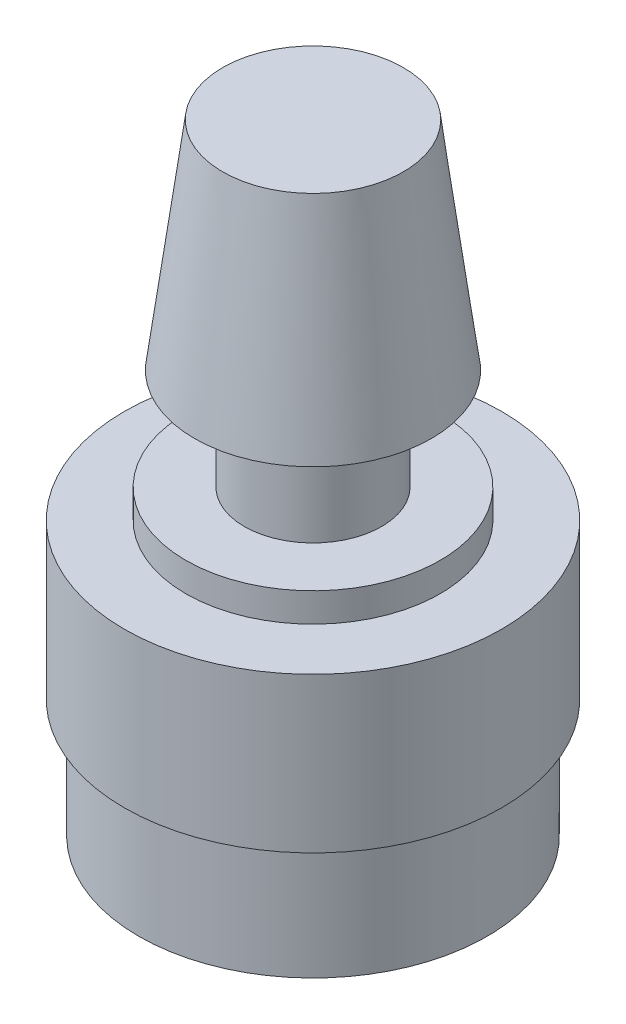
ISO-10303-21;
HEADER;
FILE_DESCRIPTION(('STEP AP214'),'2;1');
FILE_NAME('part.step','',(''),(''),'','','');
FILE_SCHEMA(('AUTOMOTIVE_DESIGN { 1 0 10303 214 1 1 1 1 }'));
ENDSEC;
DATA;
#1=APPLICATION_CONTEXT('core data for automotive mechanical design processes');
#2=APPLICATION_PROTOCOL_DEFINITION('international standard','automotive_design',2000,#1);
#3=PRODUCT_CONTEXT('',#1,'mechanical');
#4=PRODUCT('Part','Part','',(#3));
#5=PRODUCT_RELATED_PRODUCT_CATEGORY('part','',(#4));
#6=PRODUCT_DEFINITION_FORMATION('','',#4);
#7=PRODUCT_DEFINITION_CONTEXT('part definition',#1,'design');
#8=PRODUCT_DEFINITION('design','',#6,#7);
#9=PRODUCT_DEFINITION_SHAPE('','',#8);
#10=(LENGTH_UNIT() NAMED_UNIT(*) SI_UNIT(.MILLI.,.METRE.));
#11=(NAMED_UNIT(*) PLANE_ANGLE_UNIT() SI_UNIT($,.RADIAN.));
#12=(NAMED_UNIT(*) SI_UNIT($,.STERADIAN.) SOLID_ANGLE_UNIT());
#13=UNCERTAINTY_MEASURE_WITH_UNIT(LENGTH_MEASURE(1.E-05),#10,'distance_accuracy_value','');
#14=(GEOMETRIC_REPRESENTATION_CONTEXT(3) GLOBAL_UNCERTAINTY_ASSIGNED_CONTEXT((#13)) GLOBAL_UNIT_ASSIGNED_CONTEXT((#10,
#11,#12)) REPRESENTATION_CONTEXT('',''));
#15=CARTESIAN_POINT('',(0.,0.,0.));
#16=DIRECTION('',(0.,0.,1.));
#17=DIRECTION('',(1.,0.,0.));
#18=AXIS2_PLACEMENT_3D('',#15,#16,#17);
#19=CARTESIAN_POINT('',(0.,0.,0.));
#20=DIRECTION('',(0.,1.,0.));
#21=DIRECTION('',(0.,0.,1.));
#22=AXIS2_PLACEMENT_3D('',#19,#20,#21);
#23=PLANE('',#22);
#24=CARTESIAN_POINT('',(0.,0.,0.));
#25=DIRECTION('',(0.,1.,0.));
#26=DIRECTION('',(0.,0.,1.));
#27=AXIS2_PLACEMENT_3D('',#24,#25,#26);
#28=CIRCLE('',#27,13.05);
#29=CARTESIAN_POINT('',(0.,0.,13.05));
#30=VERTEX_POINT('',#29);
#31=EDGE_CURVE('E42',#30,#30,#28,.T.);
#32=ORIENTED_EDGE('',*,*,#31,.F.);
#33=EDGE_LOOP('',(#32));
#34=FACE_BOUND('',#33,.T.);
#35=CARTESIAN_POINT('',(0.,0.,0.));
#36=DIRECTION('',(0.,1.,0.));
#37=DIRECTION('',(0.,0.,1.));
#38=AXIS2_PLACEMENT_3D('',#35,#36,#37);
#39=CIRCLE('',#38,12.05);
#40=CARTESIAN_POINT('',(0.,0.,12.05));
#41=VERTEX_POINT('',#40);
#42=EDGE_CURVE('E10',#41,#41,#39,.F.);
#43=ORIENTED_EDGE('',*,*,#42,.F.);
#44=EDGE_LOOP('',(#43));
#45=FACE_BOUND('',#44,.T.);
#46=ADVANCED_FACE('F31',(#34,#45),#23,.F.);
#47=CARTESIAN_POINT('',(0.,12.7,0.));
#48=DIRECTION('',(0.,1.,0.));
#49=DIRECTION('',(0.,0.,1.));
#50=AXIS2_PLACEMENT_3D('',#47,#48,#49);
#51=PLANE('',#50);
#52=CARTESIAN_POINT('',(0.,12.7,0.));
#53=DIRECTION('',(0.,1.,0.));
#54=DIRECTION('',(0.,0.,1.));
#55=AXIS2_PLACEMENT_3D('',#52,#53,#54);
#56=CIRCLE('',#55,8.8);
#57=CARTESIAN_POINT('',(0.,12.7,8.8));
#58=VERTEX_POINT('',#57);
#59=EDGE_CURVE('E47',#58,#58,#56,.T.);
#60=ORIENTED_EDGE('',*,*,#59,.T.);
#61=EDGE_LOOP('',(#60));
#62=FACE_BOUND('',#61,.T.);
#63=CARTESIAN_POINT('',(0.,12.7,0.));
#64=DIRECTION('',(0.,1.,0.));
#65=DIRECTION('',(0.,0.,1.));
#66=AXIS2_PLACEMENT_3D('',#63,#64,#65);
#67=CIRCLE('',#66,4.75);
#68=CARTESIAN_POINT('',(0.,12.7,4.75));
#69=VERTEX_POINT('',#68);
#70=EDGE_CURVE('E55',#69,#69,#67,.T.);
#71=ORIENTED_EDGE('',*,*,#70,.F.);
#72=EDGE_LOOP('',(#71));
#73=FACE_BOUND('',#72,.T.);
#74=ADVANCED_FACE('F99',(#62,#73),#51,.T.);
#75=CARTESIAN_POINT('',(0.,10.7,0.));
#76=DIRECTION('',(0.,1.,0.));
#77=DIRECTION('',(0.,0.,1.));
#78=AXIS2_PLACEMENT_3D('',#75,#76,#77);
#79=PLANE('',#78);
#80=CARTESIAN_POINT('',(0.,10.7,0.));
#81=DIRECTION('',(0.,1.,0.));
#82=DIRECTION('',(0.,0.,1.));
#83=AXIS2_PLACEMENT_3D('',#80,#81,#82);
#84=CIRCLE('',#83,13.05);
#85=CARTESIAN_POINT('',(0.,10.7,13.05));
#86=VERTEX_POINT('',#85);
#87=EDGE_CURVE('E38',#86,#86,#84,.T.);
#88=ORIENTED_EDGE('',*,*,#87,.T.);
#89=EDGE_LOOP('',(#88));
#90=FACE_BOUND('',#89,.T.);
#91=CARTESIAN_POINT('',(0.,10.7,0.));
#92=DIRECTION('',(0.,1.,0.));
#93=DIRECTION('',(0.,0.,1.));
#94=AXIS2_PLACEMENT_3D('',#91,#92,#93);
#95=CIRCLE('',#94,8.8);
#96=CARTESIAN_POINT('',(0.,10.7,8.8));
#97=VERTEX_POINT('',#96);
#98=EDGE_CURVE('E49',#97,#97,#95,.T.);
#99=ORIENTED_EDGE('',*,*,#98,.F.);
#100=EDGE_LOOP('',(#99));
#101=FACE_BOUND('',#100,.T.);
#102=ADVANCED_FACE('F101',(#90,#101),#79,.T.);
#103=CARTESIAN_POINT('',(0.,10.7,0.));
#104=DIRECTION('',(0.,-1.,0.));
#105=DIRECTION('',(0.,0.,-1.));
#106=AXIS2_PLACEMENT_3D('',#103,#104,#105);
#107=CYLINDRICAL_SURFACE('',#106,13.05);
#108=ORIENTED_EDGE('',*,*,#87,.F.);
#109=EDGE_LOOP('',(#108));
#110=FACE_BOUND('',#109,.T.);
#111=ORIENTED_EDGE('',*,*,#31,.T.);
#112=EDGE_LOOP('',(#111));
#113=FACE_BOUND('',#112,.T.);
#114=ADVANCED_FACE('F33',(#110,#113),#107,.T.);
#115=CARTESIAN_POINT('',(0.,12.7,0.));
#116=DIRECTION('',(0.,-1.,0.));
#117=DIRECTION('',(0.,0.,-1.));
#118=AXIS2_PLACEMENT_3D('',#115,#116,#117);
#119=CYLINDRICAL_SURFACE('',#118,8.8);
#120=ORIENTED_EDGE('',*,*,#59,.F.);
#121=EDGE_LOOP('',(#120));
#122=FACE_BOUND('',#121,.T.);
#123=ORIENTED_EDGE('',*,*,#98,.T.);
#124=EDGE_LOOP('',(#123));
#125=FACE_BOUND('',#124,.T.);
#126=ADVANCED_FACE('F95',(#122,#125),#119,.T.);
#127=CARTESIAN_POINT('',(0.,19.7,0.));
#128=DIRECTION('',(0.,-1.,0.));
#129=DIRECTION('',(0.,0.,-1.));
#130=AXIS2_PLACEMENT_3D('',#127,#128,#129);
#131=CYLINDRICAL_SURFACE('',#130,4.75);
#132=CARTESIAN_POINT('',(0.,19.7,0.));
#133=DIRECTION('',(0.,1.,0.));
#134=DIRECTION('',(0.,0.,1.));
#135=AXIS2_PLACEMENT_3D('',#132,#133,#134);
#136=CIRCLE('',#135,4.75);
#137=CARTESIAN_POINT('',(0.,19.7,4.75));
#138=VERTEX_POINT('',#137);
#139=EDGE_CURVE('E52',#138,#138,#136,.T.);
#140=ORIENTED_EDGE('',*,*,#139,.F.);
#141=EDGE_LOOP('',(#140));
#142=FACE_BOUND('',#141,.T.);
#143=ORIENTED_EDGE('',*,*,#70,.T.);
#144=EDGE_LOOP('',(#143));
#145=FACE_BOUND('',#144,.T.);
#146=ADVANCED_FACE('F91',(#142,#145),#131,.T.);
#147=CARTESIAN_POINT('',(0.,-8.2,0.));
#148=DIRECTION('',(0.,-1.,0.));
#149=DIRECTION('',(0.,0.,-1.));
#150=AXIS2_PLACEMENT_3D('',#147,#148,#149);
#151=PLANE('',#150);
#152=CARTESIAN_POINT('',(0.,-8.2,0.));
#153=DIRECTION('',(0.,-1.,0.));
#154=DIRECTION('',(0.,0.,-1.));
#155=AXIS2_PLACEMENT_3D('',#152,#153,#154);
#156=CIRCLE('',#155,12.05);
#157=CARTESIAN_POINT('',(0.,-8.2,-12.05));
#158=VERTEX_POINT('',#157);
#159=EDGE_CURVE('E58',#158,#158,#156,.T.);
#160=ORIENTED_EDGE('',*,*,#159,.T.);
#161=EDGE_LOOP('',(#160));
#162=FACE_BOUND('',#161,.T.);
#163=CARTESIAN_POINT('',(0.,-8.2,0.));
#164=DIRECTION('',(0.,-1.,0.));
#165=DIRECTION('',(0.,0.,-1.));
#166=AXIS2_PLACEMENT_3D('',#163,#164,#165);
#167=CIRCLE('',#166,11.05);
#168=CARTESIAN_POINT('',(0.,-8.2,-11.05));
#169=VERTEX_POINT('',#168);
#170=EDGE_CURVE('E63',#169,#169,#167,.T.);
#171=ORIENTED_EDGE('',*,*,#170,.F.);
#172=EDGE_LOOP('',(#171));
#173=FACE_BOUND('',#172,.T.);
#174=ADVANCED_FACE('F94',(#162,#173),#151,.T.);
#175=CARTESIAN_POINT('',(0.,-8.2,0.));
#176=DIRECTION('',(0.,1.,0.));
#177=DIRECTION('',(0.,0.,1.));
#178=AXIS2_PLACEMENT_3D('',#175,#176,#177);
#179=CYLINDRICAL_SURFACE('',#178,12.05);
#180=ORIENTED_EDGE('',*,*,#159,.F.);
#181=EDGE_LOOP('',(#180));
#182=FACE_BOUND('',#181,.T.);
#183=ORIENTED_EDGE('',*,*,#42,.T.);
#184=EDGE_LOOP('',(#183));
#185=FACE_BOUND('',#184,.T.);
#186=ADVANCED_FACE('F120',(#182,#185),#179,.T.);
#187=CARTESIAN_POINT('',(0.,-8.2,0.));
#188=DIRECTION('',(0.,1.,0.));
#189=DIRECTION('',(0.,0.,1.));
#190=AXIS2_PLACEMENT_3D('',#187,#188,#189);
#191=CYLINDRICAL_SURFACE('',#190,11.05);
#192=ORIENTED_EDGE('',*,*,#170,.T.);
#193=EDGE_LOOP('',(#192));
#194=FACE_BOUND('',#193,.T.);
#195=CARTESIAN_POINT('',(0.,0.,0.));
#196=DIRECTION('',(0.,-1.,0.));
#197=DIRECTION('',(0.,0.,-1.));
#198=AXIS2_PLACEMENT_3D('',#195,#196,#197);
#199=CIRCLE('',#198,11.05);
#200=CARTESIAN_POINT('',(0.,0.,-11.05));
#201=VERTEX_POINT('',#200);
#202=EDGE_CURVE('E64',#201,#201,#199,.T.);
#203=ORIENTED_EDGE('',*,*,#202,.F.);
#204=EDGE_LOOP('',(#203));
#205=FACE_BOUND('',#204,.T.);
#206=ADVANCED_FACE('F115',(#194,#205),#191,.F.);
#207=ORIENTED_EDGE('',*,*,#202,.T.);
#208=EDGE_LOOP('',(#207));
#209=FACE_BOUND('',#208,.T.);
#210=ADVANCED_FACE('F87',(#209),#23,.F.);
#211=CARTESIAN_POINT('',(0.,19.7,0.));
#212=DIRECTION('',(0.,1.,0.));
#213=DIRECTION('',(-1.,0.,0.));
#214=AXIS2_PLACEMENT_3D('',#211,#212,#213);
#215=PLANE('',#214);
#216=CARTESIAN_POINT('',(0.,19.7,0.));
#217=DIRECTION('',(0.,1.,0.));
#218=DIRECTION('',(-1.,0.,0.));
#219=AXIS2_PLACEMENT_3D('',#216,#217,#218);
#220=CIRCLE('',#219,8.2);
#221=CARTESIAN_POINT('',(-8.2,19.7000000000001,0.));
#222=VERTEX_POINT('',#221);
#223=EDGE_CURVE('E67',#222,#222,#220,.T.);
#224=ORIENTED_EDGE('',*,*,#223,.F.);
#225=EDGE_LOOP('',(#224));
#226=FACE_BOUND('',#225,.T.);
#227=ORIENTED_EDGE('',*,*,#139,.T.);
#228=EDGE_LOOP('',(#227));
#229=FACE_BOUND('',#228,.T.);
#230=ADVANCED_FACE('F81',(#226,#229),#215,.F.);
#231=CARTESIAN_POINT('',(0.,19.7,0.));
#232=DIRECTION('',(0.,-1.,0.));
#233=DIRECTION('',(1.,0.,0.));
#234=AXIS2_PLACEMENT_3D('',#231,#232,#233);
#235=CONICAL_SURFACE('',#234,8.2,0.129275004048143);
#236=CARTESIAN_POINT('',(0.,34.7,0.));
#237=DIRECTION('',(0.,1.,0.));
#238=DIRECTION('',(-1.,0.,0.));
#239=AXIS2_PLACEMENT_3D('',#236,#237,#238);
#240=CIRCLE('',#239,6.25);
#241=CARTESIAN_POINT('',(-6.24999999999995,34.7,0.));
#242=VERTEX_POINT('',#241);
#243=EDGE_CURVE('E72',#242,#242,#240,.T.);
#244=ORIENTED_EDGE('',*,*,#243,.F.);
#245=EDGE_LOOP('',(#244));
#246=FACE_BOUND('',#245,.T.);
#247=ORIENTED_EDGE('',*,*,#223,.T.);
#248=EDGE_LOOP('',(#247));
#249=FACE_BOUND('',#248,.T.);
#250=ADVANCED_FACE('F78',(#246,#249),#235,.T.);
#251=CARTESIAN_POINT('',(6.25000000000005,34.7,0.));
#252=DIRECTION('',(0.,-1.,0.));
#253=DIRECTION('',(1.,0.,0.));
#254=AXIS2_PLACEMENT_3D('',#251,#252,#253);
#255=PLANE('',#254);
#256=ORIENTED_EDGE('',*,*,#243,.T.);
#257=EDGE_LOOP('',(#256));
#258=FACE_BOUND('',#257,.T.);
#259=ADVANCED_FACE('F76',(#258),#255,.F.);
#260=CLOSED_SHELL('',(#46,#74,#102,#114,#126,#146,#174,#186,#206,#210,#230,#250,#259));
#261=MANIFOLD_SOLID_BREP('B2',#260);
#262=ADVANCED_BREP_SHAPE_REPRESENTATION('',(#18,#261),#14);
#263=SHAPE_DEFINITION_REPRESENTATION(#9,#262);
ENDSEC;
END-ISO-10303-21;
